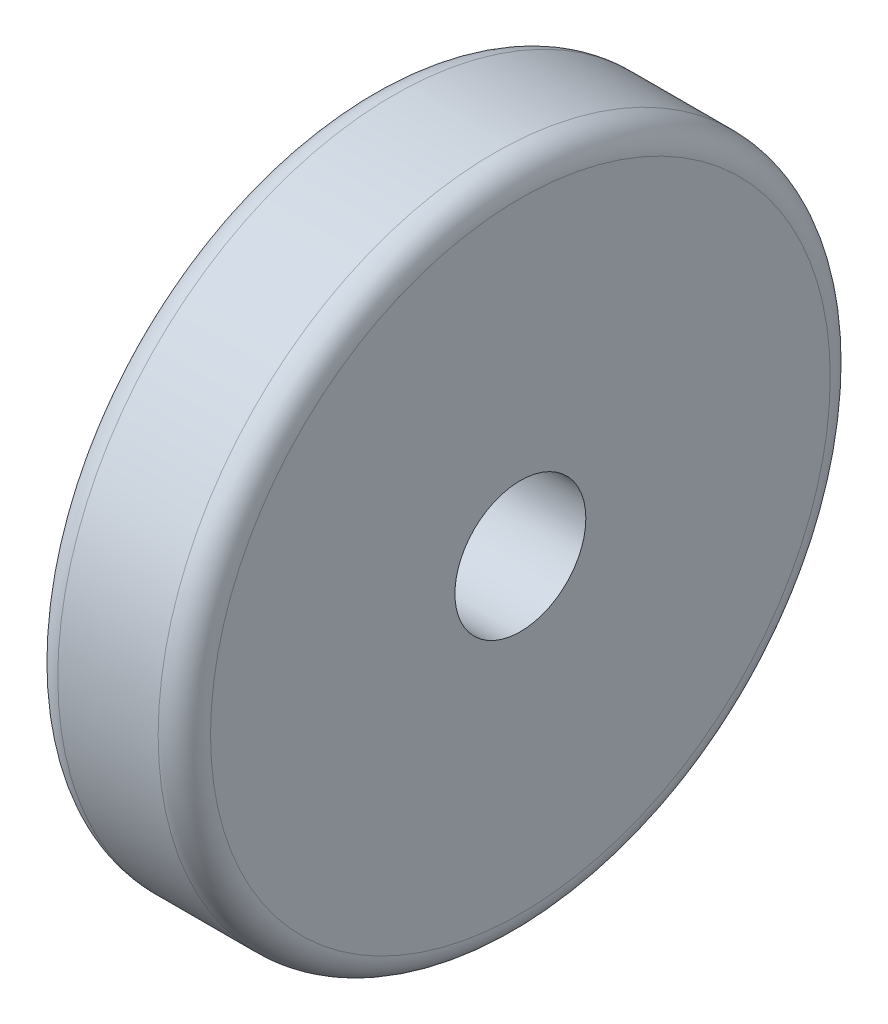
ISO-10303-21;
HEADER;
FILE_DESCRIPTION(('STEP AP214'),'2;1');
FILE_NAME('part.step','',(''),(''),'','','');
FILE_SCHEMA(('AUTOMOTIVE_DESIGN { 1 0 10303 214 1 1 1 1 }'));
ENDSEC;
DATA;
#1=APPLICATION_CONTEXT('core data for automotive mechanical design processes');
#2=APPLICATION_PROTOCOL_DEFINITION('international standard','automotive_design',2000,#1);
#3=PRODUCT_CONTEXT('',#1,'mechanical');
#4=PRODUCT('Part','Part','',(#3));
#5=PRODUCT_RELATED_PRODUCT_CATEGORY('part','',(#4));
#6=PRODUCT_DEFINITION_FORMATION('','',#4);
#7=PRODUCT_DEFINITION_CONTEXT('part definition',#1,'design');
#8=PRODUCT_DEFINITION('design','',#6,#7);
#9=PRODUCT_DEFINITION_SHAPE('','',#8);
#10=(LENGTH_UNIT() NAMED_UNIT(*) SI_UNIT(.MILLI.,.METRE.));
#11=(NAMED_UNIT(*) PLANE_ANGLE_UNIT() SI_UNIT($,.RADIAN.));
#12=(NAMED_UNIT(*) SI_UNIT($,.STERADIAN.) SOLID_ANGLE_UNIT());
#13=UNCERTAINTY_MEASURE_WITH_UNIT(LENGTH_MEASURE(1.E-05),#10,'distance_accuracy_value','');
#14=(GEOMETRIC_REPRESENTATION_CONTEXT(3) GLOBAL_UNCERTAINTY_ASSIGNED_CONTEXT((#13)) GLOBAL_UNIT_ASSIGNED_CONTEXT((#10,
#11,#12)) REPRESENTATION_CONTEXT('',''));
#15=CARTESIAN_POINT('',(0.,0.,0.));
#16=DIRECTION('',(0.,0.,1.));
#17=DIRECTION('',(1.,0.,0.));
#18=AXIS2_PLACEMENT_3D('',#15,#16,#17);
#19=CARTESIAN_POINT('',(8.75,0.,0.));
#20=DIRECTION('',(1.,0.,0.));
#21=DIRECTION('',(0.,0.,-1.));
#22=AXIS2_PLACEMENT_3D('',#19,#20,#21);
#23=PLANE('',#22);
#24=CARTESIAN_POINT('',(8.75,0.,0.));
#25=DIRECTION('',(1.,0.,0.));
#26=DIRECTION('',(0.,0.,-1.));
#27=AXIS2_PLACEMENT_3D('',#24,#25,#26);
#28=CIRCLE('',#27,35.4986660768884);
#29=CARTESIAN_POINT('',(8.75,0.,-35.4986660768884));
#30=VERTEX_POINT('',#29);
#31=EDGE_CURVE('E11',#30,#30,#28,.T.);
#32=ORIENTED_EDGE('',*,*,#31,.T.);
#33=EDGE_LOOP('',(#32));
#34=FACE_BOUND('',#33,.T.);
#35=CARTESIAN_POINT('',(8.75,0.,0.));
#36=DIRECTION('',(1.,0.,0.));
#37=DIRECTION('',(0.,0.,-1.));
#38=AXIS2_PLACEMENT_3D('',#35,#36,#37);
#39=CIRCLE('',#38,7.5);
#40=CARTESIAN_POINT('',(8.75,0.,-7.5));
#41=VERTEX_POINT('',#40);
#42=EDGE_CURVE('E61',#41,#41,#39,.T.);
#43=ORIENTED_EDGE('',*,*,#42,.F.);
#44=EDGE_LOOP('',(#43));
#45=FACE_BOUND('',#44,.T.);
#46=ADVANCED_FACE('F41',(#34,#45),#23,.T.);
#47=CARTESIAN_POINT('',(-8.75,0.,0.));
#48=DIRECTION('',(1.,0.,0.));
#49=DIRECTION('',(0.,0.,-1.));
#50=AXIS2_PLACEMENT_3D('',#47,#48,#49);
#51=PLANE('',#50);
#52=CARTESIAN_POINT('',(-8.75,0.,0.));
#53=DIRECTION('',(1.,0.,0.));
#54=DIRECTION('',(0.,0.,-1.));
#55=AXIS2_PLACEMENT_3D('',#52,#53,#54);
#56=CIRCLE('',#55,35.4986660768884);
#57=CARTESIAN_POINT('',(-8.75,0.,-35.4986660768884));
#58=VERTEX_POINT('',#57);
#59=EDGE_CURVE('E48',#58,#58,#56,.F.);
#60=ORIENTED_EDGE('',*,*,#59,.T.);
#61=EDGE_LOOP('',(#60));
#62=FACE_BOUND('',#61,.T.);
#63=CARTESIAN_POINT('',(-8.75,0.,0.));
#64=DIRECTION('',(1.,0.,0.));
#65=DIRECTION('',(0.,0.,-1.));
#66=AXIS2_PLACEMENT_3D('',#63,#64,#65);
#67=CIRCLE('',#66,7.5);
#68=CARTESIAN_POINT('',(-8.75,0.,-7.5));
#69=VERTEX_POINT('',#68);
#70=EDGE_CURVE('E62',#69,#69,#67,.T.);
#71=ORIENTED_EDGE('',*,*,#70,.T.);
#72=EDGE_LOOP('',(#71));
#73=FACE_BOUND('',#72,.T.);
#74=ADVANCED_FACE('F72',(#62,#73),#51,.F.);
#75=CARTESIAN_POINT('',(8.75,0.,0.));
#76=DIRECTION('',(-1.,0.,0.));
#77=DIRECTION('',(0.,0.,1.));
#78=AXIS2_PLACEMENT_3D('',#75,#76,#77);
#79=CYLINDRICAL_SURFACE('',#78,38.4986660768884);
#80=CARTESIAN_POINT('',(-5.75,0.,0.));
#81=DIRECTION('',(1.,0.,0.));
#82=DIRECTION('',(0.,0.,-1.));
#83=AXIS2_PLACEMENT_3D('',#80,#81,#82);
#84=CIRCLE('',#83,38.4986660768884);
#85=CARTESIAN_POINT('',(-5.75,0.,-38.4986660768884));
#86=VERTEX_POINT('',#85);
#87=EDGE_CURVE('E52',#86,#86,#84,.T.);
#88=ORIENTED_EDGE('',*,*,#87,.T.);
#89=EDGE_LOOP('',(#88));
#90=FACE_BOUND('',#89,.T.);
#91=CARTESIAN_POINT('',(5.75,0.,0.));
#92=DIRECTION('',(1.,0.,0.));
#93=DIRECTION('',(0.,0.,-1.));
#94=AXIS2_PLACEMENT_3D('',#91,#92,#93);
#95=CIRCLE('',#94,38.4986660768884);
#96=CARTESIAN_POINT('',(5.75,0.,-38.4986660768884));
#97=VERTEX_POINT('',#96);
#98=EDGE_CURVE('E56',#97,#97,#95,.F.);
#99=ORIENTED_EDGE('',*,*,#98,.T.);
#100=EDGE_LOOP('',(#99));
#101=FACE_BOUND('',#100,.T.);
#102=ADVANCED_FACE('F77',(#90,#101),#79,.T.);
#103=CARTESIAN_POINT('',(8.75,0.,0.));
#104=DIRECTION('',(-1.,0.,0.));
#105=DIRECTION('',(0.,0.,1.));
#106=AXIS2_PLACEMENT_3D('',#103,#104,#105);
#107=CYLINDRICAL_SURFACE('',#106,7.5);
#108=ORIENTED_EDGE('',*,*,#42,.T.);
#109=EDGE_LOOP('',(#108));
#110=FACE_BOUND('',#109,.T.);
#111=ORIENTED_EDGE('',*,*,#70,.F.);
#112=EDGE_LOOP('',(#111));
#113=FACE_BOUND('',#112,.T.);
#114=ADVANCED_FACE('F68',(#110,#113),#107,.F.);
#115=CARTESIAN_POINT('',(-5.75,0.,0.));
#116=DIRECTION('',(1.,0.,0.));
#117=DIRECTION('',(0.,0.,-1.));
#118=AXIS2_PLACEMENT_3D('',#115,#116,#117);
#119=TOROIDAL_SURFACE('',#118,35.4986660768884,3.);
#120=ORIENTED_EDGE('',*,*,#59,.F.);
#121=EDGE_LOOP('',(#120));
#122=FACE_BOUND('',#121,.T.);
#123=ORIENTED_EDGE('',*,*,#87,.F.);
#124=EDGE_LOOP('',(#123));
#125=FACE_BOUND('',#124,.T.);
#126=ADVANCED_FACE('F83',(#122,#125),#119,.T.);
#127=CARTESIAN_POINT('',(5.75,0.,0.));
#128=DIRECTION('',(1.,0.,0.));
#129=DIRECTION('',(0.,0.,-1.));
#130=AXIS2_PLACEMENT_3D('',#127,#128,#129);
#131=TOROIDAL_SURFACE('',#130,35.4986660768884,3.);
#132=ORIENTED_EDGE('',*,*,#98,.F.);
#133=EDGE_LOOP('',(#132));
#134=FACE_BOUND('',#133,.T.);
#135=ORIENTED_EDGE('',*,*,#31,.F.);
#136=EDGE_LOOP('',(#135));
#137=FACE_BOUND('',#136,.T.);
#138=ADVANCED_FACE('F43',(#134,#137),#131,.T.);
#139=CLOSED_SHELL('',(#46,#74,#102,#114,#126,#138));
#140=MANIFOLD_SOLID_BREP('B2',#139);
#141=ADVANCED_BREP_SHAPE_REPRESENTATION('',(#18,#140),#14);
#142=SHAPE_DEFINITION_REPRESENTATION(#9,#141);
ENDSEC;
END-ISO-10303-21;
